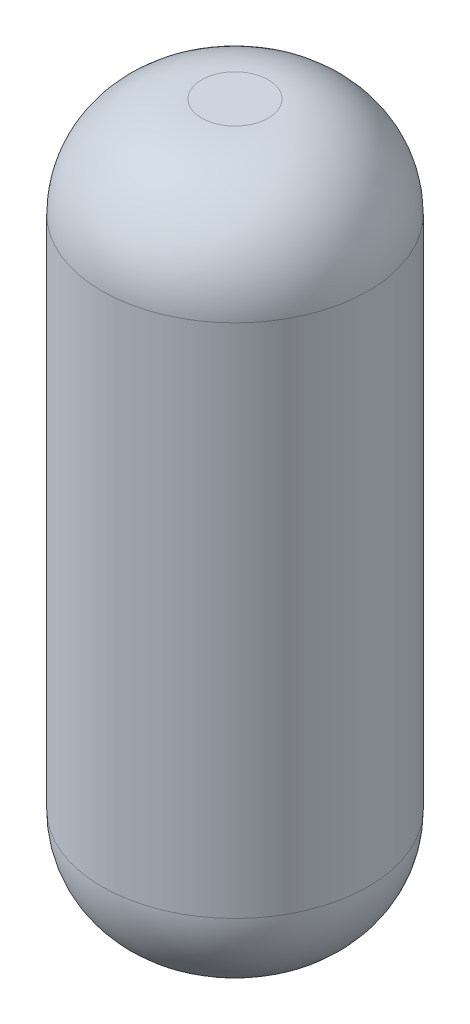
ISO-10303-21;
HEADER;
FILE_DESCRIPTION(('STEP AP214'),'2;1');
FILE_NAME('part.step','',(''),(''),'','','');
FILE_SCHEMA(('AUTOMOTIVE_DESIGN { 1 0 10303 214 1 1 1 1 }'));
ENDSEC;
DATA;
#1=APPLICATION_CONTEXT('core data for automotive mechanical design processes');
#2=APPLICATION_PROTOCOL_DEFINITION('international standard','automotive_design',2000,#1);
#3=PRODUCT_CONTEXT('',#1,'mechanical');
#4=PRODUCT('Part','Part','',(#3));
#5=PRODUCT_RELATED_PRODUCT_CATEGORY('part','',(#4));
#6=PRODUCT_DEFINITION_FORMATION('','',#4);
#7=PRODUCT_DEFINITION_CONTEXT('part definition',#1,'design');
#8=PRODUCT_DEFINITION('design','',#6,#7);
#9=PRODUCT_DEFINITION_SHAPE('','',#8);
#10=(LENGTH_UNIT() NAMED_UNIT(*) SI_UNIT(.MILLI.,.METRE.));
#11=(NAMED_UNIT(*) PLANE_ANGLE_UNIT() SI_UNIT($,.RADIAN.));
#12=(NAMED_UNIT(*) SI_UNIT($,.STERADIAN.) SOLID_ANGLE_UNIT());
#13=UNCERTAINTY_MEASURE_WITH_UNIT(LENGTH_MEASURE(1.E-05),#10,'distance_accuracy_value','');
#14=(GEOMETRIC_REPRESENTATION_CONTEXT(3) GLOBAL_UNCERTAINTY_ASSIGNED_CONTEXT((#13)) GLOBAL_UNIT_ASSIGNED_CONTEXT((#10,
#11,#12)) REPRESENTATION_CONTEXT('',''));
#15=CARTESIAN_POINT('',(0.,0.,0.));
#16=DIRECTION('',(0.,0.,1.));
#17=DIRECTION('',(1.,0.,0.));
#18=AXIS2_PLACEMENT_3D('',#15,#16,#17);
#19=CARTESIAN_POINT('',(0.,21.5,0.));
#20=DIRECTION('',(0.,-1.,0.));
#21=DIRECTION('',(0.,0.,-1.));
#22=AXIS2_PLACEMENT_3D('',#19,#20,#21);
#23=CYLINDRICAL_SURFACE('',#22,4.);
#24=CARTESIAN_POINT('',(0.,3.,0.));
#25=DIRECTION('',(0.,1.,0.));
#26=DIRECTION('',(0.,0.,1.));
#27=AXIS2_PLACEMENT_3D('',#24,#25,#26);
#28=CIRCLE('',#27,4.);
#29=CARTESIAN_POINT('',(0.,3.,4.));
#30=VERTEX_POINT('',#29);
#31=EDGE_CURVE('E42',#30,#30,#28,.T.);
#32=ORIENTED_EDGE('',*,*,#31,.T.);
#33=EDGE_LOOP('',(#32));
#34=FACE_BOUND('',#33,.T.);
#35=CARTESIAN_POINT('',(0.,18.5,0.));
#36=DIRECTION('',(0.,1.,0.));
#37=DIRECTION('',(0.,0.,1.));
#38=AXIS2_PLACEMENT_3D('',#35,#36,#37);
#39=CIRCLE('',#38,4.);
#40=CARTESIAN_POINT('',(0.,18.5,4.));
#41=VERTEX_POINT('',#40);
#42=EDGE_CURVE('E46',#41,#41,#39,.F.);
#43=ORIENTED_EDGE('',*,*,#42,.T.);
#44=EDGE_LOOP('',(#43));
#45=FACE_BOUND('',#44,.T.);
#46=ADVANCED_FACE('F31',(#34,#45),#23,.T.);
#47=CARTESIAN_POINT('',(0.,21.5,0.));
#48=DIRECTION('',(0.,1.,0.));
#49=DIRECTION('',(0.,0.,1.));
#50=AXIS2_PLACEMENT_3D('',#47,#48,#49);
#51=PLANE('',#50);
#52=CARTESIAN_POINT('',(0.,21.5,0.));
#53=DIRECTION('',(0.,1.,0.));
#54=DIRECTION('',(0.,0.,1.));
#55=AXIS2_PLACEMENT_3D('',#52,#53,#54);
#56=CIRCLE('',#55,1.);
#57=CARTESIAN_POINT('',(0.,21.5,1.));
#58=VERTEX_POINT('',#57);
#59=EDGE_CURVE('E10',#58,#58,#56,.T.);
#60=ORIENTED_EDGE('',*,*,#59,.T.);
#61=EDGE_LOOP('',(#60));
#62=FACE_BOUND('',#61,.T.);
#63=ADVANCED_FACE('F62',(#62),#51,.T.);
#64=CARTESIAN_POINT('',(0.,0.,0.));
#65=DIRECTION('',(0.,1.,0.));
#66=DIRECTION('',(0.,0.,1.));
#67=AXIS2_PLACEMENT_3D('',#64,#65,#66);
#68=PLANE('',#67);
#69=CARTESIAN_POINT('',(0.,0.,0.));
#70=DIRECTION('',(0.,1.,0.));
#71=DIRECTION('',(0.,0.,1.));
#72=AXIS2_PLACEMENT_3D('',#69,#70,#71);
#73=CIRCLE('',#72,1.);
#74=CARTESIAN_POINT('',(0.,0.,1.));
#75=VERTEX_POINT('',#74);
#76=EDGE_CURVE('E38',#75,#75,#73,.F.);
#77=ORIENTED_EDGE('',*,*,#76,.T.);
#78=EDGE_LOOP('',(#77));
#79=FACE_BOUND('',#78,.T.);
#80=ADVANCED_FACE('F59',(#79),#68,.F.);
#81=CARTESIAN_POINT('',(0.,3.,0.));
#82=DIRECTION('',(0.,1.,0.));
#83=DIRECTION('',(0.,0.,1.));
#84=AXIS2_PLACEMENT_3D('',#81,#82,#83);
#85=DEGENERATE_TOROIDAL_SURFACE('',#84,1.,3.,.T.);
#86=ORIENTED_EDGE('',*,*,#76,.F.);
#87=EDGE_LOOP('',(#86));
#88=FACE_BOUND('',#87,.T.);
#89=ORIENTED_EDGE('',*,*,#31,.F.);
#90=EDGE_LOOP('',(#89));
#91=FACE_BOUND('',#90,.T.);
#92=ADVANCED_FACE('F55',(#88,#91),#85,.T.);
#93=CARTESIAN_POINT('',(0.,18.5,0.));
#94=DIRECTION('',(0.,1.,0.));
#95=DIRECTION('',(0.,0.,1.));
#96=AXIS2_PLACEMENT_3D('',#93,#94,#95);
#97=DEGENERATE_TOROIDAL_SURFACE('',#96,1.,3.,.T.);
#98=ORIENTED_EDGE('',*,*,#42,.F.);
#99=EDGE_LOOP('',(#98));
#100=FACE_BOUND('',#99,.T.);
#101=ORIENTED_EDGE('',*,*,#59,.F.);
#102=EDGE_LOOP('',(#101));
#103=FACE_BOUND('',#102,.T.);
#104=ADVANCED_FACE('F33',(#100,#103),#97,.T.);
#105=CLOSED_SHELL('',(#46,#63,#80,#92,#104));
#106=MANIFOLD_SOLID_BREP('B2',#105);
#107=ADVANCED_BREP_SHAPE_REPRESENTATION('',(#18,#106),#14);
#108=SHAPE_DEFINITION_REPRESENTATION(#9,#107);
ENDSEC;
END-ISO-10303-21;
